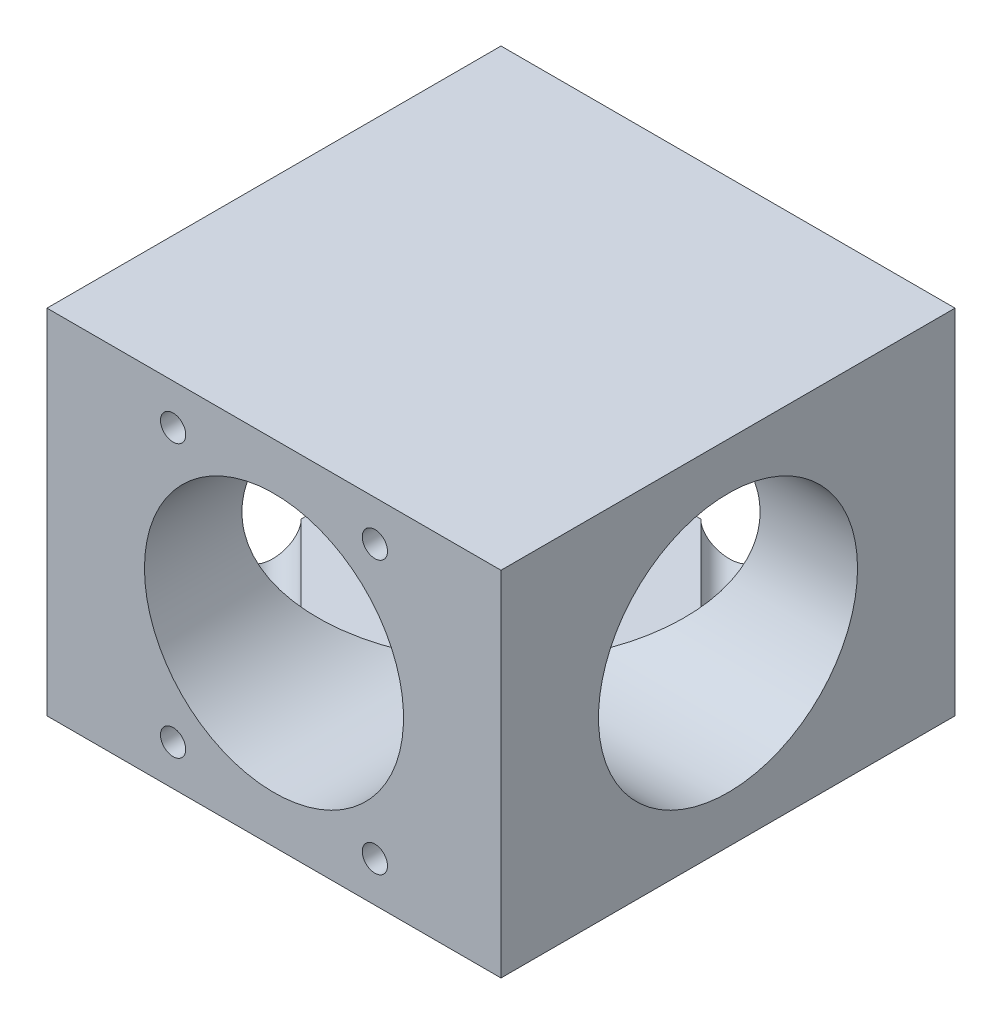
ISO-10303-21;
HEADER;
FILE_DESCRIPTION(('STEP AP214'),'2;1');
FILE_NAME('part.step','',(''),(''),'','','');
FILE_SCHEMA(('AUTOMOTIVE_DESIGN { 1 0 10303 214 1 1 1 1 }'));
ENDSEC;
DATA;
#1=APPLICATION_CONTEXT('core data for automotive mechanical design processes');
#2=APPLICATION_PROTOCOL_DEFINITION('international standard','automotive_design',2000,#1);
#3=PRODUCT_CONTEXT('',#1,'mechanical');
#4=PRODUCT('Part','Part','',(#3));
#5=PRODUCT_RELATED_PRODUCT_CATEGORY('part','',(#4));
#6=PRODUCT_DEFINITION_FORMATION('','',#4);
#7=PRODUCT_DEFINITION_CONTEXT('part definition',#1,'design');
#8=PRODUCT_DEFINITION('design','',#6,#7);
#9=PRODUCT_DEFINITION_SHAPE('','',#8);
#10=(LENGTH_UNIT() NAMED_UNIT(*) SI_UNIT(.MILLI.,.METRE.));
#11=(NAMED_UNIT(*) PLANE_ANGLE_UNIT() SI_UNIT($,.RADIAN.));
#12=(NAMED_UNIT(*) SI_UNIT($,.STERADIAN.) SOLID_ANGLE_UNIT());
#13=UNCERTAINTY_MEASURE_WITH_UNIT(LENGTH_MEASURE(1.E-05),#10,'distance_accuracy_value','');
#14=(GEOMETRIC_REPRESENTATION_CONTEXT(3) GLOBAL_UNCERTAINTY_ASSIGNED_CONTEXT((#13)) GLOBAL_UNIT_ASSIGNED_CONTEXT((#10,
#11,#12)) REPRESENTATION_CONTEXT('',''));
#15=CARTESIAN_POINT('',(0.,0.,0.));
#16=DIRECTION('',(0.,0.,1.));
#17=DIRECTION('',(1.,0.,0.));
#18=AXIS2_PLACEMENT_3D('',#15,#16,#17);
#19=CARTESIAN_POINT('',(-22.5,17.5,-22.5));
#20=DIRECTION('',(0.,0.,1.));
#21=DIRECTION('',(1.,0.,0.));
#22=AXIS2_PLACEMENT_3D('',#19,#20,#21);
#23=PLANE('',#22);
#24=CARTESIAN_POINT('',(10.,13.5,-22.5));
#25=DIRECTION('',(0.,0.,-1.));
#26=DIRECTION('',(-1.,0.,0.));
#27=AXIS2_PLACEMENT_3D('',#24,#25,#26);
#28=CIRCLE('',#27,1.24999999999999);
#29=CARTESIAN_POINT('',(8.75000000000001,13.5,-22.5));
#30=VERTEX_POINT('',#29);
#31=EDGE_CURVE('E285',#30,#30,#28,.T.);
#32=ORIENTED_EDGE('',*,*,#31,.F.);
#33=EDGE_LOOP('',(#32));
#34=FACE_BOUND('',#33,.T.);
#35=CARTESIAN_POINT('',(10.,-13.5,-22.5));
#36=DIRECTION('',(0.,0.,-1.));
#37=DIRECTION('',(-1.,0.,0.));
#38=AXIS2_PLACEMENT_3D('',#35,#36,#37);
#39=CIRCLE('',#38,1.24999999999999);
#40=CARTESIAN_POINT('',(8.75000000000001,-13.5,-22.5));
#41=VERTEX_POINT('',#40);
#42=EDGE_CURVE('E293',#41,#41,#39,.T.);
#43=ORIENTED_EDGE('',*,*,#42,.F.);
#44=EDGE_LOOP('',(#43));
#45=FACE_BOUND('',#44,.T.);
#46=DIRECTION('',(0.,-1.,0.));
#47=VECTOR('',#46,1.);
#48=CARTESIAN_POINT('',(2.95584412271575,17.5,-22.5));
#49=LINE('',#48,#47);
#50=CARTESIAN_POINT('',(2.95584412271574,-12.4948341970675,-22.5));
#51=VERTEX_POINT('',#50);
#52=CARTESIAN_POINT('',(2.95584412271573,-13.2,-22.5));
#53=VERTEX_POINT('',#52);
#54=EDGE_CURVE('E366',#51,#53,#49,.T.);
#55=ORIENTED_EDGE('',*,*,#54,.F.);
#56=CARTESIAN_POINT('',(0.,0.,-22.5));
#57=DIRECTION('',(0.,0.,-1.));
#58=DIRECTION('',(-1.,0.,0.));
#59=AXIS2_PLACEMENT_3D('',#56,#57,#58);
#60=CIRCLE('',#59,12.8397);
#61=CARTESIAN_POINT('',(2.95584412271574,12.4948341970675,-22.5));
#62=VERTEX_POINT('',#61);
#63=EDGE_CURVE('E436',#62,#51,#60,.T.);
#64=ORIENTED_EDGE('',*,*,#63,.F.);
#65=CARTESIAN_POINT('',(2.95584412271574,13.2,-22.5));
#66=VERTEX_POINT('',#65);
#67=EDGE_CURVE('E370',#66,#62,#49,.T.);
#68=ORIENTED_EDGE('',*,*,#67,.F.);
#69=CARTESIAN_POINT('',(0.127416997969552,13.2,-22.5));
#70=DIRECTION('',(0.,0.,1.));
#71=DIRECTION('',(1.,0.,0.));
#72=AXIS2_PLACEMENT_3D('',#69,#70,#71);
#73=ELLIPSE('',#72,2.82842712474619,2.);
#74=CARTESIAN_POINT('',(-2.70101012677663,13.2,-22.5));
#75=VERTEX_POINT('',#74);
#76=EDGE_CURVE('E389',#75,#66,#73,.F.);
#77=ORIENTED_EDGE('',*,*,#76,.F.);
#78=DIRECTION('',(-1.,0.,0.));
#79=VECTOR('',#78,1.);
#80=CARTESIAN_POINT('',(-22.5,13.2,-22.5));
#81=LINE('',#80,#79);
#82=CARTESIAN_POINT('',(-22.5,13.2,-22.5));
#83=VERTEX_POINT('',#82);
#84=EDGE_CURVE('E385',#75,#83,#81,.T.);
#85=ORIENTED_EDGE('',*,*,#84,.T.);
#86=DIRECTION('',(0.,-1.,0.));
#87=VECTOR('',#86,1.);
#88=CARTESIAN_POINT('',(-22.5,17.5,-22.5));
#89=LINE('',#88,#87);
#90=CARTESIAN_POINT('',(-22.5,17.5,-22.5));
#91=VERTEX_POINT('',#90);
#92=EDGE_CURVE('E483',#91,#83,#89,.T.);
#93=ORIENTED_EDGE('',*,*,#92,.F.);
#94=DIRECTION('',(-1.,0.,0.));
#95=VECTOR('',#94,1.);
#96=CARTESIAN_POINT('',(-22.5,17.5,-22.5));
#97=LINE('',#96,#95);
#98=CARTESIAN_POINT('',(22.5,17.5,-22.5));
#99=VERTEX_POINT('',#98);
#100=EDGE_CURVE('E452',#99,#91,#97,.T.);
#101=ORIENTED_EDGE('',*,*,#100,.F.);
#102=DIRECTION('',(0.,-1.,0.));
#103=VECTOR('',#102,1.);
#104=CARTESIAN_POINT('',(22.5,17.5,-22.5));
#105=LINE('',#104,#103);
#106=CARTESIAN_POINT('',(22.5,-17.5,-22.5));
#107=VERTEX_POINT('',#106);
#108=EDGE_CURVE('E487',#99,#107,#105,.T.);
#109=ORIENTED_EDGE('',*,*,#108,.T.);
#110=DIRECTION('',(-1.,0.,0.));
#111=VECTOR('',#110,1.);
#112=CARTESIAN_POINT('',(-22.5,-17.5,-22.5));
#113=LINE('',#112,#111);
#114=CARTESIAN_POINT('',(-22.5,-17.5,-22.5));
#115=VERTEX_POINT('',#114);
#116=EDGE_CURVE('E466',#107,#115,#113,.T.);
#117=ORIENTED_EDGE('',*,*,#116,.T.);
#118=CARTESIAN_POINT('',(-22.5,-13.2,-22.5));
#119=VERTEX_POINT('',#118);
#120=EDGE_CURVE('E482',#119,#115,#89,.T.);
#121=ORIENTED_EDGE('',*,*,#120,.F.);
#122=DIRECTION('',(-1.,0.,0.));
#123=VECTOR('',#122,1.);
#124=CARTESIAN_POINT('',(-22.5,-13.2,-22.5));
#125=LINE('',#124,#123);
#126=CARTESIAN_POINT('',(-2.70101012677663,-13.2,-22.5));
#127=VERTEX_POINT('',#126);
#128=EDGE_CURVE('E375',#127,#119,#125,.T.);
#129=ORIENTED_EDGE('',*,*,#128,.F.);
#130=CARTESIAN_POINT('',(0.127416997969549,-13.2,-22.5));
#131=DIRECTION('',(0.,0.,1.));
#132=DIRECTION('',(1.,0.,0.));
#133=AXIS2_PLACEMENT_3D('',#130,#131,#132);
#134=ELLIPSE('',#133,2.82842712474619,2.);
#135=EDGE_CURVE('E362',#53,#127,#134,.F.);
#136=ORIENTED_EDGE('',*,*,#135,.F.);
#137=EDGE_LOOP('',(#55,#64,#68,#77,#85,#93,#101,#109,#117,#121,#129,#136));
#138=FACE_BOUND('',#137,.T.);
#139=ADVANCED_FACE('F91',(#34,#45,#138),#23,.F.);
#140=CARTESIAN_POINT('',(0.,0.,22.5));
#141=DIRECTION('',(0.,0.,-1.));
#142=DIRECTION('',(-1.,0.,0.));
#143=AXIS2_PLACEMENT_3D('',#140,#141,#142);
#144=CYLINDRICAL_SURFACE('',#143,12.8397);
#145=CARTESIAN_POINT('',(0.,0.,-25.4558441227159));
#146=DIRECTION('',(0.707106781186554,0.,-0.707106781186542));
#147=DIRECTION('',(-0.707106781186542,0.,-0.707106781186554));
#148=AXIS2_PLACEMENT_3D('',#145,#146,#147);
#149=ELLIPSE('',#148,18.158077876802,12.8397);
#150=CARTESIAN_POINT('',(12.7279220613579,1.69053130405788,-12.7279220613578));
#151=VERTEX_POINT('',#150);
#152=EDGE_CURVE('E505',#151,#62,#149,.F.);
#153=ORIENTED_EDGE('',*,*,#152,.T.);
#154=ORIENTED_EDGE('',*,*,#63,.T.);
#155=CARTESIAN_POINT('',(12.7279220613579,-1.69053130405788,-12.7279220613578));
#156=VERTEX_POINT('',#155);
#157=EDGE_CURVE('E507',#51,#156,#149,.F.);
#158=ORIENTED_EDGE('',*,*,#157,.T.);
#159=CARTESIAN_POINT('',(0.,0.,0.));
#160=DIRECTION('',(0.707106781186548,0.,0.707106781186547));
#161=DIRECTION('',(0.707106781186548,0.,-0.707106781186547));
#162=AXIS2_PLACEMENT_3D('',#159,#160,#161);
#163=ELLIPSE('',#162,18.1580778768018,12.8397);
#164=EDGE_CURVE('E491',#151,#156,#163,.F.);
#165=ORIENTED_EDGE('',*,*,#164,.F.);
#166=EDGE_LOOP('',(#153,#154,#158,#165));
#167=FACE_BOUND('',#166,.T.);
#168=ADVANCED_FACE('F516',(#167),#144,.F.);
#169=CARTESIAN_POINT('',(0.,13.2,0.));
#170=DIRECTION('',(0.,1.,0.));
#171=DIRECTION('',(0.,0.,1.));
#172=AXIS2_PLACEMENT_3D('',#169,#170,#171);
#173=PLANE('',#172);
#174=DIRECTION('',(0.707106781186546,0.,0.707106781186549));
#175=VECTOR('',#174,1.);
#176=CARTESIAN_POINT('',(-12.6005050633883,13.2,-32.3994949366117));
#177=LINE('',#176,#175);
#178=CARTESIAN_POINT('',(9.89949493661168,13.2,-9.89949493661165));
#179=VERTEX_POINT('',#178);
#180=EDGE_CURVE('E343',#75,#179,#177,.T.);
#181=ORIENTED_EDGE('',*,*,#180,.T.);
#182=DIRECTION('',(0.707106781186549,0.,-0.707106781186546));
#183=VECTOR('',#182,1.);
#184=CARTESIAN_POINT('',(-12.7279220613579,13.2,12.7279220613578));
#185=LINE('',#184,#183);
#186=CARTESIAN_POINT('',(-9.89949493661168,13.2,9.89949493661165));
#187=VERTEX_POINT('',#186);
#188=EDGE_CURVE('E409',#187,#179,#185,.T.);
#189=ORIENTED_EDGE('',*,*,#188,.F.);
#190=DIRECTION('',(0.707106781186546,0.,0.707106781186549));
#191=VECTOR('',#190,1.);
#192=CARTESIAN_POINT('',(-32.3994949366116,13.2,-12.6005050633884));
#193=LINE('',#192,#191);
#194=CARTESIAN_POINT('',(-22.5,13.2,-2.7010101267767));
#195=VERTEX_POINT('',#194);
#196=EDGE_CURVE('E339',#195,#187,#193,.T.);
#197=ORIENTED_EDGE('',*,*,#196,.F.);
#198=DIRECTION('',(0.,0.,1.));
#199=VECTOR('',#198,1.);
#200=CARTESIAN_POINT('',(-22.5,13.2,22.5));
#201=LINE('',#200,#199);
#202=EDGE_CURVE('E381',#83,#195,#201,.T.);
#203=ORIENTED_EDGE('',*,*,#202,.F.);
#204=ORIENTED_EDGE('',*,*,#84,.F.);
#205=EDGE_LOOP('',(#181,#189,#197,#203,#204));
#206=FACE_BOUND('',#205,.T.);
#207=ADVANCED_FACE('F578',(#206),#173,.F.);
#208=CARTESIAN_POINT('',(0.,-13.2,0.));
#209=DIRECTION('',(0.,1.,0.));
#210=DIRECTION('',(0.,0.,1.));
#211=AXIS2_PLACEMENT_3D('',#208,#209,#210);
#212=PLANE('',#211);
#213=DIRECTION('',(0.707106781186549,0.,-0.707106781186546));
#214=VECTOR('',#213,1.);
#215=CARTESIAN_POINT('',(-12.7279220613579,-13.2,12.7279220613578));
#216=LINE('',#215,#214);
#217=CARTESIAN_POINT('',(-9.89949493661169,-13.2,9.89949493661165));
#218=VERTEX_POINT('',#217);
#219=CARTESIAN_POINT('',(9.89949493661168,-13.2,-9.89949493661165));
#220=VERTEX_POINT('',#219);
#221=EDGE_CURVE('E397',#218,#220,#216,.T.);
#222=ORIENTED_EDGE('',*,*,#221,.T.);
#223=DIRECTION('',(0.707106781186546,0.,0.707106781186549));
#224=VECTOR('',#223,1.);
#225=CARTESIAN_POINT('',(-12.6005050633883,-13.2,-32.3994949366117));
#226=LINE('',#225,#224);
#227=EDGE_CURVE('E12',#220,#127,#226,.F.);
#228=ORIENTED_EDGE('',*,*,#227,.T.);
#229=ORIENTED_EDGE('',*,*,#128,.T.);
#230=DIRECTION('',(0.,0.,1.));
#231=VECTOR('',#230,1.);
#232=CARTESIAN_POINT('',(-22.5,-13.2,22.5));
#233=LINE('',#232,#231);
#234=CARTESIAN_POINT('',(-22.5,-13.2,-2.70101012677669));
#235=VERTEX_POINT('',#234);
#236=EDGE_CURVE('E371',#119,#235,#233,.T.);
#237=ORIENTED_EDGE('',*,*,#236,.T.);
#238=DIRECTION('',(0.707106781186546,0.,0.707106781186549));
#239=VECTOR('',#238,1.);
#240=CARTESIAN_POINT('',(-32.3994949366116,-13.2,-12.6005050633884));
#241=LINE('',#240,#239);
#242=EDGE_CURVE('E100',#235,#218,#241,.T.);
#243=ORIENTED_EDGE('',*,*,#242,.T.);
#244=EDGE_LOOP('',(#222,#228,#229,#237,#243));
#245=FACE_BOUND('',#244,.T.);
#246=ADVANCED_FACE('F553',(#245),#212,.T.);
#247=CARTESIAN_POINT('',(-22.501,0.,0.));
#248=DIRECTION('',(1.,0.,0.));
#249=DIRECTION('',(0.,0.,-1.));
#250=AXIS2_PLACEMENT_3D('',#247,#248,#249);
#251=CYLINDRICAL_SURFACE('',#250,12.8397);
#252=CARTESIAN_POINT('',(22.5,0.,0.));
#253=DIRECTION('',(1.,0.,0.));
#254=DIRECTION('',(0.,0.,-1.));
#255=AXIS2_PLACEMENT_3D('',#252,#253,#254);
#256=CIRCLE('',#255,12.8397);
#257=CARTESIAN_POINT('',(22.5,0.,-12.8397));
#258=VERTEX_POINT('',#257);
#259=EDGE_CURVE('E435',#258,#258,#256,.T.);
#260=ORIENTED_EDGE('',*,*,#259,.T.);
#261=EDGE_LOOP('',(#260));
#262=FACE_BOUND('',#261,.T.);
#263=CARTESIAN_POINT('',(0.,12.8397,0.));
#264=VERTEX_POINT('',#263);
#265=EDGE_CURVE('E492',#264,#151,#163,.F.);
#266=ORIENTED_EDGE('',*,*,#265,.T.);
#267=ORIENTED_EDGE('',*,*,#164,.T.);
#268=CARTESIAN_POINT('',(0.,0.,0.));
#269=DIRECTION('',(0.707106781186546,0.,0.707106781186549));
#270=DIRECTION('',(0.707106781186549,0.,-0.707106781186546));
#271=AXIS2_PLACEMENT_3D('',#268,#269,#270);
#272=ELLIPSE('',#271,18.1580778768018,12.8397);
#273=CARTESIAN_POINT('',(0.,-12.8397,0.));
#274=VERTEX_POINT('',#273);
#275=EDGE_CURVE('E419',#156,#274,#272,.F.);
#276=ORIENTED_EDGE('',*,*,#275,.T.);
#277=CARTESIAN_POINT('',(0.,0.,0.));
#278=DIRECTION('',(0.707106781186548,0.,-0.707106781186547));
#279=DIRECTION('',(0.707106781186548,0.,0.707106781186547));
#280=AXIS2_PLACEMENT_3D('',#277,#278,#279);
#281=ELLIPSE('',#280,18.1580778768018,12.8397);
#282=EDGE_CURVE('E500',#274,#264,#281,.F.);
#283=ORIENTED_EDGE('',*,*,#282,.T.);
#284=EDGE_LOOP('',(#266,#267,#276,#283));
#285=FACE_BOUND('',#284,.T.);
#286=ADVANCED_FACE('F521',(#262,#285),#251,.F.);
#287=CARTESIAN_POINT('',(22.5,17.5,22.5));
#288=DIRECTION('',(-1.,0.,0.));
#289=DIRECTION('',(0.,0.,1.));
#290=AXIS2_PLACEMENT_3D('',#287,#288,#289);
#291=PLANE('',#290);
#292=ORIENTED_EDGE('',*,*,#259,.F.);
#293=EDGE_LOOP('',(#292));
#294=FACE_BOUND('',#293,.T.);
#295=DIRECTION('',(0.,0.,-1.));
#296=VECTOR('',#295,1.);
#297=CARTESIAN_POINT('',(22.5,-17.5,22.5));
#298=LINE('',#297,#296);
#299=CARTESIAN_POINT('',(22.5,-17.5,22.5));
#300=VERTEX_POINT('',#299);
#301=EDGE_CURVE('E447',#300,#107,#298,.T.);
#302=ORIENTED_EDGE('',*,*,#301,.T.);
#303=ORIENTED_EDGE('',*,*,#108,.F.);
#304=DIRECTION('',(0.,0.,-1.));
#305=VECTOR('',#304,1.);
#306=CARTESIAN_POINT('',(22.5,17.5,22.5));
#307=LINE('',#306,#305);
#308=CARTESIAN_POINT('',(22.5,17.5,22.5));
#309=VERTEX_POINT('',#308);
#310=EDGE_CURVE('E448',#309,#99,#307,.T.);
#311=ORIENTED_EDGE('',*,*,#310,.F.);
#312=DIRECTION('',(0.,-1.,0.));
#313=VECTOR('',#312,1.);
#314=CARTESIAN_POINT('',(22.5,17.5,22.5));
#315=LINE('',#314,#313);
#316=EDGE_CURVE('E462',#309,#300,#315,.T.);
#317=ORIENTED_EDGE('',*,*,#316,.T.);
#318=EDGE_LOOP('',(#302,#303,#311,#317));
#319=FACE_BOUND('',#318,.T.);
#320=ADVANCED_FACE('F93',(#294,#319),#291,.F.);
#321=CARTESIAN_POINT('',(-22.5,17.5,22.5));
#322=DIRECTION('',(1.,0.,0.));
#323=DIRECTION('',(0.,0.,-1.));
#324=AXIS2_PLACEMENT_3D('',#321,#322,#323);
#325=PLANE('',#324);
#326=CARTESIAN_POINT('',(-22.5,0.,0.));
#327=DIRECTION('',(1.,0.,0.));
#328=DIRECTION('',(0.,0.,-1.));
#329=AXIS2_PLACEMENT_3D('',#326,#327,#328);
#330=CIRCLE('',#329,12.8397);
#331=CARTESIAN_POINT('',(-22.5,-12.4948341970675,2.9558441227157));
#332=VERTEX_POINT('',#331);
#333=CARTESIAN_POINT('',(-22.5,12.4948341970675,2.9558441227157));
#334=VERTEX_POINT('',#333);
#335=EDGE_CURVE('E443',#332,#334,#330,.F.);
#336=ORIENTED_EDGE('',*,*,#335,.F.);
#337=DIRECTION('',(0.,-1.,0.));
#338=VECTOR('',#337,1.);
#339=CARTESIAN_POINT('',(-22.5,17.5,2.95584412271569));
#340=LINE('',#339,#338);
#341=CARTESIAN_POINT('',(-22.5,-13.2,2.9558441227157));
#342=VERTEX_POINT('',#341);
#343=EDGE_CURVE('E357',#332,#342,#340,.T.);
#344=ORIENTED_EDGE('',*,*,#343,.T.);
#345=CARTESIAN_POINT('',(-22.5,-13.2,0.127416997969504));
#346=DIRECTION('',(1.,0.,0.));
#347=DIRECTION('',(0.,0.,1.));
#348=AXIS2_PLACEMENT_3D('',#345,#346,#347);
#349=ELLIPSE('',#348,2.82842712474619,2.);
#350=EDGE_CURVE('E346',#235,#342,#349,.F.);
#351=ORIENTED_EDGE('',*,*,#350,.F.);
#352=ORIENTED_EDGE('',*,*,#236,.F.);
#353=ORIENTED_EDGE('',*,*,#120,.T.);
#354=DIRECTION('',(0.,0.,1.));
#355=VECTOR('',#354,1.);
#356=CARTESIAN_POINT('',(-22.5,-17.5,22.5));
#357=LINE('',#356,#355);
#358=CARTESIAN_POINT('',(-22.5,-17.5,22.5));
#359=VERTEX_POINT('',#358);
#360=EDGE_CURVE('E470',#115,#359,#357,.T.);
#361=ORIENTED_EDGE('',*,*,#360,.T.);
#362=DIRECTION('',(0.,-1.,0.));
#363=VECTOR('',#362,1.);
#364=CARTESIAN_POINT('',(-22.5,17.5,22.5));
#365=LINE('',#364,#363);
#366=CARTESIAN_POINT('',(-22.5,17.5,22.5));
#367=VERTEX_POINT('',#366);
#368=EDGE_CURVE('E478',#367,#359,#365,.T.);
#369=ORIENTED_EDGE('',*,*,#368,.F.);
#370=DIRECTION('',(0.,0.,1.));
#371=VECTOR('',#370,1.);
#372=CARTESIAN_POINT('',(-22.5,17.5,22.5));
#373=LINE('',#372,#371);
#374=EDGE_CURVE('E456',#91,#367,#373,.T.);
#375=ORIENTED_EDGE('',*,*,#374,.F.);
#376=ORIENTED_EDGE('',*,*,#92,.T.);
#377=ORIENTED_EDGE('',*,*,#202,.T.);
#378=CARTESIAN_POINT('',(-22.5,13.2,0.1274169979695));
#379=DIRECTION('',(1.,0.,0.));
#380=DIRECTION('',(0.,0.,1.));
#381=AXIS2_PLACEMENT_3D('',#378,#379,#380);
#382=ELLIPSE('',#381,2.8284271247462,2.);
#383=CARTESIAN_POINT('',(-22.5,13.2,2.9558441227157));
#384=VERTEX_POINT('',#383);
#385=EDGE_CURVE('E378',#384,#195,#382,.F.);
#386=ORIENTED_EDGE('',*,*,#385,.F.);
#387=EDGE_CURVE('E361',#384,#334,#340,.T.);
#388=ORIENTED_EDGE('',*,*,#387,.T.);
#389=EDGE_LOOP('',(#336,#344,#351,#352,#353,#361,#369,#375,#376,#377,#386,#388));
#390=FACE_BOUND('',#389,.T.);
#391=ADVANCED_FACE('F539',(#390),#325,.F.);
#392=CARTESIAN_POINT('',(-22.5,17.5,22.5));
#393=DIRECTION('',(0.,0.,-1.));
#394=DIRECTION('',(-1.,0.,0.));
#395=AXIS2_PLACEMENT_3D('',#392,#393,#394);
#396=PLANE('',#395);
#397=CARTESIAN_POINT('',(-10.,-13.5,22.5));
#398=DIRECTION('',(0.,0.,1.));
#399=DIRECTION('',(1.,0.,0.));
#400=AXIS2_PLACEMENT_3D('',#397,#398,#399);
#401=CIRCLE('',#400,1.25);
#402=CARTESIAN_POINT('',(-8.75,-13.5,22.5));
#403=VERTEX_POINT('',#402);
#404=EDGE_CURVE('E301',#403,#403,#401,.T.);
#405=ORIENTED_EDGE('',*,*,#404,.F.);
#406=EDGE_LOOP('',(#405));
#407=FACE_BOUND('',#406,.T.);
#408=CARTESIAN_POINT('',(10.,-13.5,22.5));
#409=DIRECTION('',(0.,0.,1.));
#410=DIRECTION('',(1.,0.,0.));
#411=AXIS2_PLACEMENT_3D('',#408,#409,#410);
#412=CIRCLE('',#411,1.25);
#413=CARTESIAN_POINT('',(11.25,-13.5,22.5));
#414=VERTEX_POINT('',#413);
#415=EDGE_CURVE('E309',#414,#414,#412,.T.);
#416=ORIENTED_EDGE('',*,*,#415,.F.);
#417=EDGE_LOOP('',(#416));
#418=FACE_BOUND('',#417,.T.);
#419=CARTESIAN_POINT('',(10.,13.5,22.5));
#420=DIRECTION('',(0.,0.,1.));
#421=DIRECTION('',(1.,0.,0.));
#422=AXIS2_PLACEMENT_3D('',#419,#420,#421);
#423=CIRCLE('',#422,1.25);
#424=CARTESIAN_POINT('',(11.25,13.5,22.5));
#425=VERTEX_POINT('',#424);
#426=EDGE_CURVE('E317',#425,#425,#423,.T.);
#427=ORIENTED_EDGE('',*,*,#426,.F.);
#428=EDGE_LOOP('',(#427));
#429=FACE_BOUND('',#428,.T.);
#430=CARTESIAN_POINT('',(-10.,13.5,22.5));
#431=DIRECTION('',(0.,0.,1.));
#432=DIRECTION('',(1.,0.,0.));
#433=AXIS2_PLACEMENT_3D('',#430,#431,#432);
#434=CIRCLE('',#433,1.25);
#435=CARTESIAN_POINT('',(-8.75,13.5,22.5));
#436=VERTEX_POINT('',#435);
#437=EDGE_CURVE('E325',#436,#436,#434,.T.);
#438=ORIENTED_EDGE('',*,*,#437,.F.);
#439=EDGE_LOOP('',(#438));
#440=FACE_BOUND('',#439,.T.);
#441=CARTESIAN_POINT('',(0.,0.,22.5));
#442=DIRECTION('',(0.,0.,-1.));
#443=DIRECTION('',(-1.,0.,0.));
#444=AXIS2_PLACEMENT_3D('',#441,#442,#443);
#445=CIRCLE('',#444,12.8397);
#446=CARTESIAN_POINT('',(-12.8397,0.,22.5));
#447=VERTEX_POINT('',#446);
#448=EDGE_CURVE('E431',#447,#447,#445,.T.);
#449=ORIENTED_EDGE('',*,*,#448,.T.);
#450=EDGE_LOOP('',(#449));
#451=FACE_BOUND('',#450,.T.);
#452=DIRECTION('',(1.,0.,0.));
#453=VECTOR('',#452,1.);
#454=CARTESIAN_POINT('',(-22.5,-17.5,22.5));
#455=LINE('',#454,#453);
#456=EDGE_CURVE('E453',#359,#300,#455,.T.);
#457=ORIENTED_EDGE('',*,*,#456,.T.);
#458=ORIENTED_EDGE('',*,*,#316,.F.);
#459=DIRECTION('',(1.,0.,0.));
#460=VECTOR('',#459,1.);
#461=CARTESIAN_POINT('',(-22.5,17.5,22.5));
#462=LINE('',#461,#460);
#463=EDGE_CURVE('E459',#367,#309,#462,.T.);
#464=ORIENTED_EDGE('',*,*,#463,.F.);
#465=ORIENTED_EDGE('',*,*,#368,.T.);
#466=EDGE_LOOP('',(#457,#458,#464,#465));
#467=FACE_BOUND('',#466,.T.);
#468=ADVANCED_FACE('F564',(#407,#418,#429,#440,#451,#467),#396,.F.);
#469=CARTESIAN_POINT('',(0.,17.5,0.));
#470=DIRECTION('',(0.,-1.,0.));
#471=DIRECTION('',(0.,0.,-1.));
#472=AXIS2_PLACEMENT_3D('',#469,#470,#471);
#473=PLANE('',#472);
#474=ORIENTED_EDGE('',*,*,#310,.T.);
#475=ORIENTED_EDGE('',*,*,#100,.T.);
#476=ORIENTED_EDGE('',*,*,#374,.T.);
#477=ORIENTED_EDGE('',*,*,#463,.T.);
#478=EDGE_LOOP('',(#474,#475,#476,#477));
#479=FACE_BOUND('',#478,.T.);
#480=ADVANCED_FACE('F572',(#479),#473,.F.);
#481=CARTESIAN_POINT('',(0.,-17.5,0.));
#482=DIRECTION('',(0.,-1.,0.));
#483=DIRECTION('',(0.,0.,-1.));
#484=AXIS2_PLACEMENT_3D('',#481,#482,#483);
#485=PLANE('',#484);
#486=ORIENTED_EDGE('',*,*,#301,.F.);
#487=ORIENTED_EDGE('',*,*,#456,.F.);
#488=ORIENTED_EDGE('',*,*,#360,.F.);
#489=ORIENTED_EDGE('',*,*,#116,.F.);
#490=EDGE_LOOP('',(#486,#487,#488,#489));
#491=FACE_BOUND('',#490,.T.);
#492=ADVANCED_FACE('F567',(#491),#485,.T.);
#493=CARTESIAN_POINT('',(-25.4558441227158,0.,0.));
#494=DIRECTION('',(-0.707106781186544,0.,0.707106781186551));
#495=DIRECTION('',(0.707106781186551,0.,0.707106781186544));
#496=AXIS2_PLACEMENT_3D('',#493,#494,#495);
#497=ELLIPSE('',#496,18.1580778768019,12.8397);
#498=CARTESIAN_POINT('',(-12.7279220613579,-1.69053130405783,12.7279220613579));
#499=VERTEX_POINT('',#498);
#500=EDGE_CURVE('E430',#499,#332,#497,.F.);
#501=ORIENTED_EDGE('',*,*,#500,.T.);
#502=ORIENTED_EDGE('',*,*,#335,.T.);
#503=CARTESIAN_POINT('',(-12.7279220613579,1.69053130405782,12.7279220613578));
#504=VERTEX_POINT('',#503);
#505=EDGE_CURVE('E426',#334,#504,#497,.F.);
#506=ORIENTED_EDGE('',*,*,#505,.T.);
#507=CARTESIAN_POINT('',(0.,0.,0.));
#508=DIRECTION('',(0.707106781186548,0.,0.707106781186547));
#509=DIRECTION('',(0.707106781186548,0.,-0.707106781186547));
#510=AXIS2_PLACEMENT_3D('',#507,#508,#509);
#511=ELLIPSE('',#510,18.1580778768018,12.8397);
#512=EDGE_CURVE('E501',#504,#499,#511,.T.);
#513=ORIENTED_EDGE('',*,*,#512,.T.);
#514=EDGE_LOOP('',(#501,#502,#506,#513));
#515=FACE_BOUND('',#514,.T.);
#516=ADVANCED_FACE('F542',(#515),#251,.F.);
#517=ORIENTED_EDGE('',*,*,#448,.F.);
#518=EDGE_LOOP('',(#517));
#519=FACE_BOUND('',#518,.T.);
#520=EDGE_CURVE('E497',#264,#504,#511,.T.);
#521=ORIENTED_EDGE('',*,*,#520,.F.);
#522=ORIENTED_EDGE('',*,*,#282,.F.);
#523=EDGE_CURVE('E496',#499,#274,#511,.T.);
#524=ORIENTED_EDGE('',*,*,#523,.F.);
#525=ORIENTED_EDGE('',*,*,#512,.F.);
#526=EDGE_LOOP('',(#521,#522,#524,#525));
#527=FACE_BOUND('',#526,.T.);
#528=ADVANCED_FACE('F593',(#519,#527),#144,.F.);
#529=CARTESIAN_POINT('',(-12.7279220613579,-13.2,12.7279220613578));
#530=DIRECTION('',(0.707106781186546,0.,0.707106781186549));
#531=DIRECTION('',(0.707106781186549,0.,-0.707106781186546));
#532=AXIS2_PLACEMENT_3D('',#529,#530,#531);
#533=PLANE('',#532);
#534=CARTESIAN_POINT('',(11.3137084989848,13.75,-11.3137084989848));
#535=DIRECTION('',(-0.707106781186546,0.,-0.707106781186549));
#536=DIRECTION('',(-0.707106781186549,0.,0.707106781186546));
#537=AXIS2_PLACEMENT_3D('',#534,#535,#536);
#538=CIRCLE('',#537,0.79999999999999);
#539=CARTESIAN_POINT('',(10.7480230740355,13.75,-10.7480230740355));
#540=VERTEX_POINT('',#539);
#541=EDGE_CURVE('E255',#540,#540,#538,.T.);
#542=ORIENTED_EDGE('',*,*,#541,.F.);
#543=EDGE_LOOP('',(#542));
#544=FACE_BOUND('',#543,.T.);
#545=CARTESIAN_POINT('',(-11.3137084989848,13.75,11.3137084989847));
#546=DIRECTION('',(-0.707106781186546,0.,-0.707106781186549));
#547=DIRECTION('',(-0.707106781186549,0.,0.707106781186546));
#548=AXIS2_PLACEMENT_3D('',#545,#546,#547);
#549=CIRCLE('',#548,0.79999999999999);
#550=CARTESIAN_POINT('',(-11.879393923934,13.75,11.879393923934));
#551=VERTEX_POINT('',#550);
#552=EDGE_CURVE('E269',#551,#551,#549,.T.);
#553=ORIENTED_EDGE('',*,*,#552,.F.);
#554=EDGE_LOOP('',(#553));
#555=FACE_BOUND('',#554,.T.);
#556=ORIENTED_EDGE('',*,*,#520,.T.);
#557=DIRECTION('',(0.,1.,0.));
#558=VECTOR('',#557,1.);
#559=CARTESIAN_POINT('',(-12.7279220613579,-13.2,12.7279220613578));
#560=LINE('',#559,#558);
#561=CARTESIAN_POINT('',(-12.7279220613579,13.2,12.7279220613578));
#562=VERTEX_POINT('',#561);
#563=EDGE_CURVE('E405',#504,#562,#560,.T.);
#564=ORIENTED_EDGE('',*,*,#563,.T.);
#565=CARTESIAN_POINT('',(-11.3137084989848,13.2,11.3137084989847));
#566=DIRECTION('',(-0.707106781186546,0.,-0.707106781186549));
#567=DIRECTION('',(-0.707106781186549,0.,0.707106781186546));
#568=AXIS2_PLACEMENT_3D('',#565,#566,#567);
#569=CIRCLE('',#568,2.);
#570=EDGE_CURVE('E333',#562,#187,#569,.T.);
#571=ORIENTED_EDGE('',*,*,#570,.T.);
#572=ORIENTED_EDGE('',*,*,#188,.T.);
#573=CARTESIAN_POINT('',(11.3137084989848,13.2,-11.3137084989847));
#574=DIRECTION('',(-0.707106781186546,0.,-0.707106781186549));
#575=DIRECTION('',(-0.707106781186549,0.,0.707106781186546));
#576=AXIS2_PLACEMENT_3D('',#573,#574,#575);
#577=CIRCLE('',#576,2.);
#578=CARTESIAN_POINT('',(12.7279220613579,13.2,-12.7279220613578));
#579=VERTEX_POINT('',#578);
#580=EDGE_CURVE('E334',#179,#579,#577,.T.);
#581=ORIENTED_EDGE('',*,*,#580,.T.);
#582=DIRECTION('',(0.,1.,0.));
#583=VECTOR('',#582,1.);
#584=CARTESIAN_POINT('',(12.7279220613579,-13.2,-12.7279220613578));
#585=LINE('',#584,#583);
#586=EDGE_CURVE('E420',#151,#579,#585,.T.);
#587=ORIENTED_EDGE('',*,*,#586,.F.);
#588=ORIENTED_EDGE('',*,*,#265,.F.);
#589=EDGE_LOOP('',(#556,#564,#571,#572,#581,#587,#588));
#590=FACE_BOUND('',#589,.T.);
#591=ADVANCED_FACE('F586',(#544,#555,#590),#533,.F.);
#592=CARTESIAN_POINT('',(12.7279220613579,-13.2,-12.7279220613578));
#593=DIRECTION('',(0.707106781186554,0.,-0.707106781186542));
#594=DIRECTION('',(-0.707106781186542,0.,-0.707106781186554));
#595=AXIS2_PLACEMENT_3D('',#592,#593,#594);
#596=PLANE('',#595);
#597=ORIENTED_EDGE('',*,*,#586,.T.);
#598=DIRECTION('',(-0.707106781186541,0.,-0.707106781186553));
#599=VECTOR('',#598,1.);
#600=CARTESIAN_POINT('',(12.7279220613579,13.2,-12.7279220613578));
#601=LINE('',#600,#599);
#602=EDGE_CURVE('E398',#579,#66,#601,.T.);
#603=ORIENTED_EDGE('',*,*,#602,.T.);
#604=ORIENTED_EDGE('',*,*,#67,.T.);
#605=ORIENTED_EDGE('',*,*,#152,.F.);
#606=EDGE_LOOP('',(#597,#603,#604,#605));
#607=FACE_BOUND('',#606,.T.);
#608=ADVANCED_FACE('F639',(#607),#596,.F.);
#609=CARTESIAN_POINT('',(-13.5410948597224,-13.2,11.9147492629933));
#610=DIRECTION('',(-0.707106781186544,0.,0.707106781186551));
#611=DIRECTION('',(0.707106781186551,0.,0.707106781186544));
#612=AXIS2_PLACEMENT_3D('',#609,#610,#611);
#613=PLANE('',#612);
#614=ORIENTED_EDGE('',*,*,#505,.F.);
#615=ORIENTED_EDGE('',*,*,#387,.F.);
#616=DIRECTION('',(0.70710678118655,0.,0.707106781186544));
#617=VECTOR('',#616,1.);
#618=CARTESIAN_POINT('',(-13.5410948597224,13.2,11.9147492629933));
#619=LINE('',#618,#617);
#620=EDGE_CURVE('E393',#384,#562,#619,.T.);
#621=ORIENTED_EDGE('',*,*,#620,.T.);
#622=ORIENTED_EDGE('',*,*,#563,.F.);
#623=EDGE_LOOP('',(#614,#615,#621,#622));
#624=FACE_BOUND('',#623,.T.);
#625=ADVANCED_FACE('F590',(#624),#613,.F.);
#626=ORIENTED_EDGE('',*,*,#157,.F.);
#627=ORIENTED_EDGE('',*,*,#54,.T.);
#628=DIRECTION('',(-0.707106781186541,0.,-0.707106781186553));
#629=VECTOR('',#628,1.);
#630=CARTESIAN_POINT('',(12.7279220613579,-13.2,-12.7279220613578));
#631=LINE('',#630,#629);
#632=CARTESIAN_POINT('',(12.7279220613579,-13.2,-12.7279220613578));
#633=VERTEX_POINT('',#632);
#634=EDGE_CURVE('E402',#633,#53,#631,.T.);
#635=ORIENTED_EDGE('',*,*,#634,.F.);
#636=EDGE_CURVE('E415',#633,#156,#585,.T.);
#637=ORIENTED_EDGE('',*,*,#636,.T.);
#638=EDGE_LOOP('',(#626,#627,#635,#637));
#639=FACE_BOUND('',#638,.T.);
#640=ADVANCED_FACE('F598',(#639),#596,.F.);
#641=CARTESIAN_POINT('',(-12.7279220613579,-13.2,12.7279220613578));
#642=VERTEX_POINT('',#641);
#643=EDGE_CURVE('E114',#642,#499,#560,.T.);
#644=ORIENTED_EDGE('',*,*,#643,.F.);
#645=DIRECTION('',(0.70710678118655,0.,0.707106781186544));
#646=VECTOR('',#645,1.);
#647=CARTESIAN_POINT('',(-13.5410948597224,-13.2,11.9147492629933));
#648=LINE('',#647,#646);
#649=EDGE_CURVE('E394',#342,#642,#648,.T.);
#650=ORIENTED_EDGE('',*,*,#649,.F.);
#651=ORIENTED_EDGE('',*,*,#343,.F.);
#652=ORIENTED_EDGE('',*,*,#500,.F.);
#653=EDGE_LOOP('',(#644,#650,#651,#652));
#654=FACE_BOUND('',#653,.T.);
#655=ADVANCED_FACE('F548',(#654),#613,.F.);
#656=CARTESIAN_POINT('',(11.3137084989848,-13.75,-11.3137084989848));
#657=DIRECTION('',(-0.707106781186546,0.,-0.707106781186549));
#658=DIRECTION('',(-0.707106781186549,0.,0.707106781186546));
#659=AXIS2_PLACEMENT_3D('',#656,#657,#658);
#660=CIRCLE('',#659,0.79999999999999);
#661=CARTESIAN_POINT('',(10.7480230740355,-13.75,-10.7480230740355));
#662=VERTEX_POINT('',#661);
#663=EDGE_CURVE('E256',#662,#662,#660,.T.);
#664=ORIENTED_EDGE('',*,*,#663,.F.);
#665=EDGE_LOOP('',(#664));
#666=FACE_BOUND('',#665,.T.);
#667=CARTESIAN_POINT('',(-11.3137084989848,-13.75,11.3137084989847));
#668=DIRECTION('',(-0.707106781186546,0.,-0.707106781186549));
#669=DIRECTION('',(-0.707106781186549,0.,0.707106781186546));
#670=AXIS2_PLACEMENT_3D('',#667,#668,#669);
#671=CIRCLE('',#670,0.79999999999999);
#672=CARTESIAN_POINT('',(-11.879393923934,-13.75,11.879393923934));
#673=VERTEX_POINT('',#672);
#674=EDGE_CURVE('E277',#673,#673,#671,.T.);
#675=ORIENTED_EDGE('',*,*,#674,.F.);
#676=EDGE_LOOP('',(#675));
#677=FACE_BOUND('',#676,.T.);
#678=ORIENTED_EDGE('',*,*,#636,.F.);
#679=CARTESIAN_POINT('',(11.3137084989848,-13.2,-11.3137084989847));
#680=DIRECTION('',(-0.707106781186546,0.,-0.707106781186549));
#681=DIRECTION('',(-0.707106781186549,0.,0.707106781186546));
#682=AXIS2_PLACEMENT_3D('',#679,#680,#681);
#683=CIRCLE('',#682,2.);
#684=EDGE_CURVE('E338',#633,#220,#683,.T.);
#685=ORIENTED_EDGE('',*,*,#684,.T.);
#686=ORIENTED_EDGE('',*,*,#221,.F.);
#687=CARTESIAN_POINT('',(-11.3137084989848,-13.2,11.3137084989847));
#688=DIRECTION('',(-0.707106781186546,0.,-0.707106781186549));
#689=DIRECTION('',(-0.707106781186549,0.,0.707106781186546));
#690=AXIS2_PLACEMENT_3D('',#687,#688,#689);
#691=CIRCLE('',#690,2.);
#692=EDGE_CURVE('E107',#218,#642,#691,.T.);
#693=ORIENTED_EDGE('',*,*,#692,.T.);
#694=ORIENTED_EDGE('',*,*,#643,.T.);
#695=ORIENTED_EDGE('',*,*,#523,.T.);
#696=ORIENTED_EDGE('',*,*,#275,.F.);
#697=EDGE_LOOP('',(#678,#685,#686,#693,#694,#695,#696));
#698=FACE_BOUND('',#697,.T.);
#699=ADVANCED_FACE('F596',(#666,#677,#698),#533,.F.);
#700=CARTESIAN_POINT('',(-33.8137084989847,-13.2,-11.1862915010153));
#701=DIRECTION('',(0.707106781186546,0.,0.707106781186549));
#702=DIRECTION('',(0.707106781186549,0.,-0.707106781186546));
#703=AXIS2_PLACEMENT_3D('',#700,#701,#702);
#704=CYLINDRICAL_SURFACE('',#703,2.);
#705=ORIENTED_EDGE('',*,*,#350,.T.);
#706=ORIENTED_EDGE('',*,*,#649,.T.);
#707=ORIENTED_EDGE('',*,*,#692,.F.);
#708=ORIENTED_EDGE('',*,*,#242,.F.);
#709=EDGE_LOOP('',(#705,#706,#707,#708));
#710=FACE_BOUND('',#709,.T.);
#711=ADVANCED_FACE('F552',(#710),#704,.F.);
#712=CARTESIAN_POINT('',(-11.1862915010152,-13.2,-33.8137084989848));
#713=DIRECTION('',(0.707106781186546,0.,0.707106781186549));
#714=DIRECTION('',(0.707106781186549,0.,-0.707106781186546));
#715=AXIS2_PLACEMENT_3D('',#712,#713,#714);
#716=CYLINDRICAL_SURFACE('',#715,2.);
#717=ORIENTED_EDGE('',*,*,#135,.T.);
#718=ORIENTED_EDGE('',*,*,#227,.F.);
#719=ORIENTED_EDGE('',*,*,#684,.F.);
#720=ORIENTED_EDGE('',*,*,#634,.T.);
#721=EDGE_LOOP('',(#717,#718,#719,#720));
#722=FACE_BOUND('',#721,.T.);
#723=ADVANCED_FACE('F600',(#722),#716,.F.);
#724=CARTESIAN_POINT('',(-11.1862915010152,13.2,-33.8137084989848));
#725=DIRECTION('',(0.707106781186546,0.,0.707106781186549));
#726=DIRECTION('',(0.707106781186549,0.,-0.707106781186546));
#727=AXIS2_PLACEMENT_3D('',#724,#725,#726);
#728=CYLINDRICAL_SURFACE('',#727,2.);
#729=ORIENTED_EDGE('',*,*,#76,.T.);
#730=ORIENTED_EDGE('',*,*,#602,.F.);
#731=ORIENTED_EDGE('',*,*,#580,.F.);
#732=ORIENTED_EDGE('',*,*,#180,.F.);
#733=EDGE_LOOP('',(#729,#730,#731,#732));
#734=FACE_BOUND('',#733,.T.);
#735=ADVANCED_FACE('F583',(#734),#728,.F.);
#736=CARTESIAN_POINT('',(-33.8137084989847,13.2,-11.1862915010153));
#737=DIRECTION('',(0.707106781186546,0.,0.707106781186549));
#738=DIRECTION('',(0.707106781186549,0.,-0.707106781186546));
#739=AXIS2_PLACEMENT_3D('',#736,#737,#738);
#740=CYLINDRICAL_SURFACE('',#739,2.);
#741=ORIENTED_EDGE('',*,*,#385,.T.);
#742=ORIENTED_EDGE('',*,*,#196,.T.);
#743=ORIENTED_EDGE('',*,*,#570,.F.);
#744=ORIENTED_EDGE('',*,*,#620,.F.);
#745=EDGE_LOOP('',(#741,#742,#743,#744));
#746=FACE_BOUND('',#745,.T.);
#747=ADVANCED_FACE('F588',(#746),#740,.F.);
#748=CARTESIAN_POINT('',(-10.,13.5,16.));
#749=DIRECTION('',(0.,0.,1.));
#750=DIRECTION('',(1.,0.,0.));
#751=AXIS2_PLACEMENT_3D('',#748,#749,#750);
#752=CONICAL_SURFACE('',#751,1.25,1.02974425867665);
#753=CARTESIAN_POINT('',(-10.,13.5,15.2489242262155));
#754=VERTEX_POINT('',#753);
#755=VERTEX_LOOP('',#754);
#756=FACE_BOUND('',#755,.T.);
#757=CARTESIAN_POINT('',(-10.,13.5,16.));
#758=DIRECTION('',(0.,0.,1.));
#759=DIRECTION('',(1.,0.,0.));
#760=AXIS2_PLACEMENT_3D('',#757,#758,#759);
#761=CIRCLE('',#760,1.25);
#762=CARTESIAN_POINT('',(-8.75,13.5,16.));
#763=VERTEX_POINT('',#762);
#764=EDGE_CURVE('E329',#763,#763,#761,.T.);
#765=ORIENTED_EDGE('',*,*,#764,.T.);
#766=EDGE_LOOP('',(#765));
#767=FACE_BOUND('',#766,.T.);
#768=ADVANCED_FACE('F645',(#756,#767),#752,.F.);
#769=CARTESIAN_POINT('',(-10.,13.5,22.5));
#770=DIRECTION('',(0.,0.,1.));
#771=DIRECTION('',(1.,0.,0.));
#772=AXIS2_PLACEMENT_3D('',#769,#770,#771);
#773=CYLINDRICAL_SURFACE('',#772,1.25);
#774=ORIENTED_EDGE('',*,*,#764,.F.);
#775=EDGE_LOOP('',(#774));
#776=FACE_BOUND('',#775,.T.);
#777=ORIENTED_EDGE('',*,*,#437,.T.);
#778=EDGE_LOOP('',(#777));
#779=FACE_BOUND('',#778,.T.);
#780=ADVANCED_FACE('F649',(#776,#779),#773,.F.);
#781=CARTESIAN_POINT('',(10.,13.5,16.));
#782=DIRECTION('',(0.,0.,1.));
#783=DIRECTION('',(1.,0.,0.));
#784=AXIS2_PLACEMENT_3D('',#781,#782,#783);
#785=CONICAL_SURFACE('',#784,1.25,1.02974425867665);
#786=CARTESIAN_POINT('',(10.,13.5,15.2489242262155));
#787=VERTEX_POINT('',#786);
#788=VERTEX_LOOP('',#787);
#789=FACE_BOUND('',#788,.T.);
#790=CARTESIAN_POINT('',(10.,13.5,16.));
#791=DIRECTION('',(0.,0.,1.));
#792=DIRECTION('',(1.,0.,0.));
#793=AXIS2_PLACEMENT_3D('',#790,#791,#792);
#794=CIRCLE('',#793,1.25);
#795=CARTESIAN_POINT('',(11.25,13.5,16.));
#796=VERTEX_POINT('',#795);
#797=EDGE_CURVE('E321',#796,#796,#794,.T.);
#798=ORIENTED_EDGE('',*,*,#797,.T.);
#799=EDGE_LOOP('',(#798));
#800=FACE_BOUND('',#799,.T.);
#801=ADVANCED_FACE('F654',(#789,#800),#785,.F.);
#802=CARTESIAN_POINT('',(10.,13.5,22.5));
#803=DIRECTION('',(0.,0.,1.));
#804=DIRECTION('',(1.,0.,0.));
#805=AXIS2_PLACEMENT_3D('',#802,#803,#804);
#806=CYLINDRICAL_SURFACE('',#805,1.25);
#807=ORIENTED_EDGE('',*,*,#797,.F.);
#808=EDGE_LOOP('',(#807));
#809=FACE_BOUND('',#808,.T.);
#810=ORIENTED_EDGE('',*,*,#426,.T.);
#811=EDGE_LOOP('',(#810));
#812=FACE_BOUND('',#811,.T.);
#813=ADVANCED_FACE('F661',(#809,#812),#806,.F.);
#814=CARTESIAN_POINT('',(10.,-13.5,16.));
#815=DIRECTION('',(0.,0.,1.));
#816=DIRECTION('',(1.,0.,0.));
#817=AXIS2_PLACEMENT_3D('',#814,#815,#816);
#818=CONICAL_SURFACE('',#817,1.25,1.02974425867665);
#819=CARTESIAN_POINT('',(10.,-13.5,15.2489242262155));
#820=VERTEX_POINT('',#819);
#821=VERTEX_LOOP('',#820);
#822=FACE_BOUND('',#821,.T.);
#823=CARTESIAN_POINT('',(10.,-13.5,16.));
#824=DIRECTION('',(0.,0.,1.));
#825=DIRECTION('',(1.,0.,0.));
#826=AXIS2_PLACEMENT_3D('',#823,#824,#825);
#827=CIRCLE('',#826,1.25);
#828=CARTESIAN_POINT('',(11.25,-13.5,16.));
#829=VERTEX_POINT('',#828);
#830=EDGE_CURVE('E313',#829,#829,#827,.T.);
#831=ORIENTED_EDGE('',*,*,#830,.T.);
#832=EDGE_LOOP('',(#831));
#833=FACE_BOUND('',#832,.T.);
#834=ADVANCED_FACE('F665',(#822,#833),#818,.F.);
#835=CARTESIAN_POINT('',(10.,-13.5,22.5));
#836=DIRECTION('',(0.,0.,1.));
#837=DIRECTION('',(1.,0.,0.));
#838=AXIS2_PLACEMENT_3D('',#835,#836,#837);
#839=CYLINDRICAL_SURFACE('',#838,1.25);
#840=ORIENTED_EDGE('',*,*,#830,.F.);
#841=EDGE_LOOP('',(#840));
#842=FACE_BOUND('',#841,.T.);
#843=ORIENTED_EDGE('',*,*,#415,.T.);
#844=EDGE_LOOP('',(#843));
#845=FACE_BOUND('',#844,.T.);
#846=ADVANCED_FACE('F669',(#842,#845),#839,.F.);
#847=CARTESIAN_POINT('',(-10.,-13.5,16.));
#848=DIRECTION('',(0.,0.,1.));
#849=DIRECTION('',(1.,0.,0.));
#850=AXIS2_PLACEMENT_3D('',#847,#848,#849);
#851=CONICAL_SURFACE('',#850,1.25,1.02974425867665);
#852=CARTESIAN_POINT('',(-10.,-13.5,15.2489242262155));
#853=VERTEX_POINT('',#852);
#854=VERTEX_LOOP('',#853);
#855=FACE_BOUND('',#854,.T.);
#856=CARTESIAN_POINT('',(-10.,-13.5,16.));
#857=DIRECTION('',(0.,0.,1.));
#858=DIRECTION('',(1.,0.,0.));
#859=AXIS2_PLACEMENT_3D('',#856,#857,#858);
#860=CIRCLE('',#859,1.25);
#861=CARTESIAN_POINT('',(-8.75,-13.5,16.));
#862=VERTEX_POINT('',#861);
#863=EDGE_CURVE('E305',#862,#862,#860,.T.);
#864=ORIENTED_EDGE('',*,*,#863,.T.);
#865=EDGE_LOOP('',(#864));
#866=FACE_BOUND('',#865,.T.);
#867=ADVANCED_FACE('F673',(#855,#866),#851,.F.);
#868=CARTESIAN_POINT('',(-10.,-13.5,22.5));
#869=DIRECTION('',(0.,0.,1.));
#870=DIRECTION('',(1.,0.,0.));
#871=AXIS2_PLACEMENT_3D('',#868,#869,#870);
#872=CYLINDRICAL_SURFACE('',#871,1.25);
#873=ORIENTED_EDGE('',*,*,#863,.F.);
#874=EDGE_LOOP('',(#873));
#875=FACE_BOUND('',#874,.T.);
#876=ORIENTED_EDGE('',*,*,#404,.T.);
#877=EDGE_LOOP('',(#876));
#878=FACE_BOUND('',#877,.T.);
#879=ADVANCED_FACE('F677',(#875,#878),#872,.F.);
#880=CARTESIAN_POINT('',(10.,-13.5,-17.));
#881=DIRECTION('',(0.,0.,-1.));
#882=DIRECTION('',(-1.,0.,0.));
#883=AXIS2_PLACEMENT_3D('',#880,#881,#882);
#884=CONICAL_SURFACE('',#883,1.25,1.02974425867665);
#885=CARTESIAN_POINT('',(10.,-13.5,-16.2489242262155));
#886=VERTEX_POINT('',#885);
#887=VERTEX_LOOP('',#886);
#888=FACE_BOUND('',#887,.T.);
#889=CARTESIAN_POINT('',(10.,-13.5,-17.));
#890=DIRECTION('',(0.,0.,-1.));
#891=DIRECTION('',(-1.,0.,0.));
#892=AXIS2_PLACEMENT_3D('',#889,#890,#891);
#893=CIRCLE('',#892,1.25);
#894=CARTESIAN_POINT('',(8.75,-13.5,-17.));
#895=VERTEX_POINT('',#894);
#896=EDGE_CURVE('E297',#895,#895,#893,.T.);
#897=ORIENTED_EDGE('',*,*,#896,.T.);
#898=EDGE_LOOP('',(#897));
#899=FACE_BOUND('',#898,.T.);
#900=ADVANCED_FACE('F681',(#888,#899),#884,.F.);
#901=CARTESIAN_POINT('',(10.,-13.5,-22.5));
#902=DIRECTION('',(0.,0.,-1.));
#903=DIRECTION('',(-1.,0.,0.));
#904=AXIS2_PLACEMENT_3D('',#901,#902,#903);
#905=CYLINDRICAL_SURFACE('',#904,1.24999999999999);
#906=ORIENTED_EDGE('',*,*,#896,.F.);
#907=EDGE_LOOP('',(#906));
#908=FACE_BOUND('',#907,.T.);
#909=ORIENTED_EDGE('',*,*,#42,.T.);
#910=EDGE_LOOP('',(#909));
#911=FACE_BOUND('',#910,.T.);
#912=ADVANCED_FACE('F685',(#908,#911),#905,.F.);
#913=CARTESIAN_POINT('',(10.,13.5,-17.));
#914=DIRECTION('',(0.,0.,-1.));
#915=DIRECTION('',(-1.,0.,0.));
#916=AXIS2_PLACEMENT_3D('',#913,#914,#915);
#917=CONICAL_SURFACE('',#916,1.25,1.02974425867665);
#918=CARTESIAN_POINT('',(10.,13.5,-16.2489242262155));
#919=VERTEX_POINT('',#918);
#920=VERTEX_LOOP('',#919);
#921=FACE_BOUND('',#920,.T.);
#922=CARTESIAN_POINT('',(10.,13.5,-17.));
#923=DIRECTION('',(0.,0.,-1.));
#924=DIRECTION('',(-1.,0.,0.));
#925=AXIS2_PLACEMENT_3D('',#922,#923,#924);
#926=CIRCLE('',#925,1.25);
#927=CARTESIAN_POINT('',(8.75,13.5,-17.));
#928=VERTEX_POINT('',#927);
#929=EDGE_CURVE('E289',#928,#928,#926,.T.);
#930=ORIENTED_EDGE('',*,*,#929,.T.);
#931=EDGE_LOOP('',(#930));
#932=FACE_BOUND('',#931,.T.);
#933=ADVANCED_FACE('F689',(#921,#932),#917,.F.);
#934=CARTESIAN_POINT('',(10.,13.5,-22.5));
#935=DIRECTION('',(0.,0.,-1.));
#936=DIRECTION('',(-1.,0.,0.));
#937=AXIS2_PLACEMENT_3D('',#934,#935,#936);
#938=CYLINDRICAL_SURFACE('',#937,1.24999999999999);
#939=ORIENTED_EDGE('',*,*,#929,.F.);
#940=EDGE_LOOP('',(#939));
#941=FACE_BOUND('',#940,.T.);
#942=ORIENTED_EDGE('',*,*,#31,.T.);
#943=EDGE_LOOP('',(#942));
#944=FACE_BOUND('',#943,.T.);
#945=ADVANCED_FACE('F693',(#941,#944),#938,.F.);
#946=CARTESIAN_POINT('',(-7.63675323681473,-13.75,14.9906637611548));
#947=DIRECTION('',(-0.707106781186546,0.,-0.707106781186549));
#948=DIRECTION('',(-0.707106781186549,0.,0.707106781186546));
#949=AXIS2_PLACEMENT_3D('',#946,#947,#948);
#950=CONICAL_SURFACE('',#949,0.799999999999999,1.02974425867665);
#951=CARTESIAN_POINT('',(-7.29685514220486,-13.75,15.3305618557647));
#952=VERTEX_POINT('',#951);
#953=VERTEX_LOOP('',#952);
#954=FACE_BOUND('',#953,.T.);
#955=CARTESIAN_POINT('',(-7.63675323681473,-13.75,14.9906637611548));
#956=DIRECTION('',(-0.707106781186546,0.,-0.707106781186549));
#957=DIRECTION('',(-0.707106781186549,0.,0.707106781186546));
#958=AXIS2_PLACEMENT_3D('',#955,#956,#957);
#959=CIRCLE('',#958,0.799999999999999);
#960=CARTESIAN_POINT('',(-8.20243866176397,-13.75,15.556349186104));
#961=VERTEX_POINT('',#960);
#962=EDGE_CURVE('E281',#961,#961,#959,.T.);
#963=ORIENTED_EDGE('',*,*,#962,.T.);
#964=EDGE_LOOP('',(#963));
#965=FACE_BOUND('',#964,.T.);
#966=ADVANCED_FACE('F697',(#954,#965),#950,.F.);
#967=CARTESIAN_POINT('',(-11.3137084989848,-13.75,11.3137084989847));
#968=DIRECTION('',(-0.707106781186546,0.,-0.707106781186549));
#969=DIRECTION('',(-0.707106781186549,0.,0.707106781186546));
#970=AXIS2_PLACEMENT_3D('',#967,#968,#969);
#971=CYLINDRICAL_SURFACE('',#970,0.799999999999994);
#972=ORIENTED_EDGE('',*,*,#962,.F.);
#973=EDGE_LOOP('',(#972));
#974=FACE_BOUND('',#973,.T.);
#975=ORIENTED_EDGE('',*,*,#674,.T.);
#976=EDGE_LOOP('',(#975));
#977=FACE_BOUND('',#976,.T.);
#978=ADVANCED_FACE('F701',(#974,#977),#971,.F.);
#979=CARTESIAN_POINT('',(-7.63675323681473,13.75,14.9906637611548));
#980=DIRECTION('',(-0.707106781186546,0.,-0.707106781186549));
#981=DIRECTION('',(-0.707106781186549,0.,0.707106781186546));
#982=AXIS2_PLACEMENT_3D('',#979,#980,#981);
#983=CONICAL_SURFACE('',#982,0.799999999999999,1.02974425867665);
#984=CARTESIAN_POINT('',(-7.29685514220486,13.75,15.3305618557647));
#985=VERTEX_POINT('',#984);
#986=VERTEX_LOOP('',#985);
#987=FACE_BOUND('',#986,.T.);
#988=CARTESIAN_POINT('',(-7.63675323681473,13.75,14.9906637611548));
#989=DIRECTION('',(-0.707106781186546,0.,-0.707106781186549));
#990=DIRECTION('',(-0.707106781186549,0.,0.707106781186546));
#991=AXIS2_PLACEMENT_3D('',#988,#989,#990);
#992=CIRCLE('',#991,0.799999999999999);
#993=CARTESIAN_POINT('',(-8.20243866176397,13.75,15.556349186104));
#994=VERTEX_POINT('',#993);
#995=EDGE_CURVE('E273',#994,#994,#992,.T.);
#996=ORIENTED_EDGE('',*,*,#995,.T.);
#997=EDGE_LOOP('',(#996));
#998=FACE_BOUND('',#997,.T.);
#999=ADVANCED_FACE('F705',(#987,#998),#983,.F.);
#1000=CARTESIAN_POINT('',(-11.3137084989848,13.75,11.3137084989847));
#1001=DIRECTION('',(-0.707106781186546,0.,-0.707106781186549));
#1002=DIRECTION('',(-0.707106781186549,0.,0.707106781186546));
#1003=AXIS2_PLACEMENT_3D('',#1000,#1001,#1002);
#1004=CYLINDRICAL_SURFACE('',#1003,0.799999999999994);
#1005=ORIENTED_EDGE('',*,*,#995,.F.);
#1006=EDGE_LOOP('',(#1005));
#1007=FACE_BOUND('',#1006,.T.);
#1008=ORIENTED_EDGE('',*,*,#552,.T.);
#1009=EDGE_LOOP('',(#1008));
#1010=FACE_BOUND('',#1009,.T.);
#1011=ADVANCED_FACE('F709',(#1007,#1010),#1004,.F.);
#1012=CARTESIAN_POINT('',(14.9906637611548,13.75,-7.6367532368147));
#1013=DIRECTION('',(-0.707106781186546,0.,-0.707106781186549));
#1014=DIRECTION('',(-0.707106781186549,0.,0.707106781186546));
#1015=AXIS2_PLACEMENT_3D('',#1012,#1013,#1014);
#1016=CONICAL_SURFACE('',#1015,0.799999999999999,1.02974425867665);
#1017=CARTESIAN_POINT('',(15.3305618557647,13.75,-7.29685514220483));
#1018=VERTEX_POINT('',#1017);
#1019=VERTEX_LOOP('',#1018);
#1020=FACE_BOUND('',#1019,.T.);
#1021=CARTESIAN_POINT('',(14.9906637611548,13.75,-7.6367532368147));
#1022=DIRECTION('',(-0.707106781186546,0.,-0.707106781186549));
#1023=DIRECTION('',(-0.707106781186549,0.,0.707106781186546));
#1024=AXIS2_PLACEMENT_3D('',#1021,#1022,#1023);
#1025=CIRCLE('',#1024,0.799999999999999);
#1026=CARTESIAN_POINT('',(14.4249783362056,13.75,-7.07106781186546));
#1027=VERTEX_POINT('',#1026);
#1028=EDGE_CURVE('E261',#1027,#1027,#1025,.T.);
#1029=ORIENTED_EDGE('',*,*,#1028,.T.);
#1030=EDGE_LOOP('',(#1029));
#1031=FACE_BOUND('',#1030,.T.);
#1032=ADVANCED_FACE('F713',(#1020,#1031),#1016,.F.);
#1033=CARTESIAN_POINT('',(11.3137084989848,13.75,-11.3137084989847));
#1034=DIRECTION('',(-0.707106781186546,0.,-0.707106781186549));
#1035=DIRECTION('',(-0.707106781186549,0.,0.707106781186546));
#1036=AXIS2_PLACEMENT_3D('',#1033,#1034,#1035);
#1037=CYLINDRICAL_SURFACE('',#1036,0.799999999999994);
#1038=ORIENTED_EDGE('',*,*,#1028,.F.);
#1039=EDGE_LOOP('',(#1038));
#1040=FACE_BOUND('',#1039,.T.);
#1041=ORIENTED_EDGE('',*,*,#541,.T.);
#1042=EDGE_LOOP('',(#1041));
#1043=FACE_BOUND('',#1042,.T.);
#1044=ADVANCED_FACE('F248',(#1040,#1043),#1037,.F.);
#1045=CARTESIAN_POINT('',(14.9906637611548,-13.75,-7.6367532368147));
#1046=DIRECTION('',(-0.707106781186546,0.,-0.707106781186549));
#1047=DIRECTION('',(-0.707106781186549,0.,0.707106781186546));
#1048=AXIS2_PLACEMENT_3D('',#1045,#1046,#1047);
#1049=CONICAL_SURFACE('',#1048,0.799999999999999,1.02974425867665);
#1050=CARTESIAN_POINT('',(15.3305618557647,-13.75,-7.29685514220483));
#1051=VERTEX_POINT('',#1050);
#1052=VERTEX_LOOP('',#1051);
#1053=FACE_BOUND('',#1052,.T.);
#1054=CARTESIAN_POINT('',(14.9906637611548,-13.75,-7.6367532368147));
#1055=DIRECTION('',(-0.707106781186546,0.,-0.707106781186549));
#1056=DIRECTION('',(-0.707106781186549,0.,0.707106781186546));
#1057=AXIS2_PLACEMENT_3D('',#1054,#1055,#1056);
#1058=CIRCLE('',#1057,0.799999999999999);
#1059=CARTESIAN_POINT('',(14.4249783362056,-13.75,-7.07106781186546));
#1060=VERTEX_POINT('',#1059);
#1061=EDGE_CURVE('E252',#1060,#1060,#1058,.T.);
#1062=ORIENTED_EDGE('',*,*,#1061,.T.);
#1063=EDGE_LOOP('',(#1062));
#1064=FACE_BOUND('',#1063,.T.);
#1065=ADVANCED_FACE('F244',(#1053,#1064),#1049,.F.);
#1066=CARTESIAN_POINT('',(11.3137084989848,-13.75,-11.3137084989847));
#1067=DIRECTION('',(-0.707106781186546,0.,-0.707106781186549));
#1068=DIRECTION('',(-0.707106781186549,0.,0.707106781186546));
#1069=AXIS2_PLACEMENT_3D('',#1066,#1067,#1068);
#1070=CYLINDRICAL_SURFACE('',#1069,0.799999999999994);
#1071=ORIENTED_EDGE('',*,*,#1061,.F.);
#1072=EDGE_LOOP('',(#1071));
#1073=FACE_BOUND('',#1072,.T.);
#1074=ORIENTED_EDGE('',*,*,#663,.T.);
#1075=EDGE_LOOP('',(#1074));
#1076=FACE_BOUND('',#1075,.T.);
#1077=ADVANCED_FACE('F247',(#1073,#1076),#1070,.F.);
#1078=CLOSED_SHELL('',(#139,#168,#207,#246,#286,#320,#391,#468,#480,#492,#516,#528,#591,#608,
#625,#640,#655,#699,#711,#723,#735,#747,#768,#780,#801,#813,#834,#846,#867,#879,#900,#912,#933,
#945,#966,#978,#999,#1011,#1032,#1044,#1065,#1077));
#1079=MANIFOLD_SOLID_BREP('B2',#1078);
#1080=ADVANCED_BREP_SHAPE_REPRESENTATION('',(#18,#1079),#14);
#1081=SHAPE_DEFINITION_REPRESENTATION(#9,#1080);
ENDSEC;
END-ISO-10303-21;
